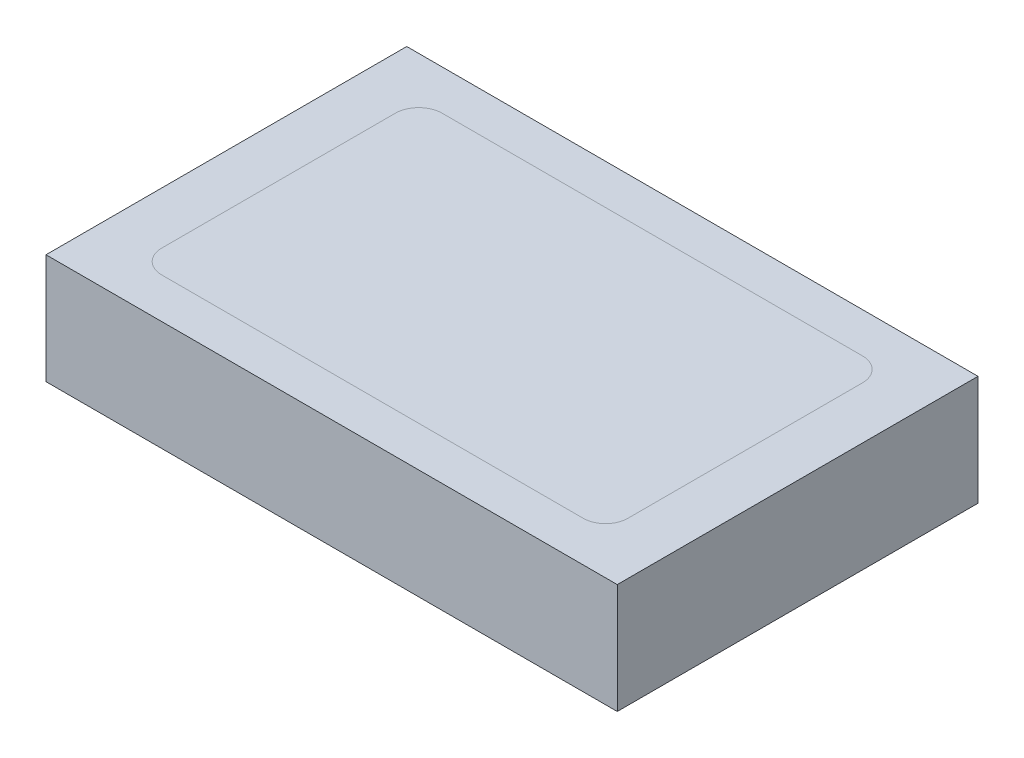
ISO-10303-21;
HEADER;
FILE_DESCRIPTION(('STEP AP214'),'2;1');
FILE_NAME('part.step','',(''),(''),'','','');
FILE_SCHEMA(('AUTOMOTIVE_DESIGN { 1 0 10303 214 1 1 1 1 }'));
ENDSEC;
DATA;
#1=APPLICATION_CONTEXT('core data for automotive mechanical design processes');
#2=APPLICATION_PROTOCOL_DEFINITION('international standard','automotive_design',2000,#1);
#3=PRODUCT_CONTEXT('',#1,'mechanical');
#4=PRODUCT('Part','Part','',(#3));
#5=PRODUCT_RELATED_PRODUCT_CATEGORY('part','',(#4));
#6=PRODUCT_DEFINITION_FORMATION('','',#4);
#7=PRODUCT_DEFINITION_CONTEXT('part definition',#1,'design');
#8=PRODUCT_DEFINITION('design','',#6,#7);
#9=PRODUCT_DEFINITION_SHAPE('','',#8);
#10=(LENGTH_UNIT() NAMED_UNIT(*) SI_UNIT(.MILLI.,.METRE.));
#11=(NAMED_UNIT(*) PLANE_ANGLE_UNIT() SI_UNIT($,.RADIAN.));
#12=(NAMED_UNIT(*) SI_UNIT($,.STERADIAN.) SOLID_ANGLE_UNIT());
#13=UNCERTAINTY_MEASURE_WITH_UNIT(LENGTH_MEASURE(1.E-05),#10,'distance_accuracy_value','');
#14=(GEOMETRIC_REPRESENTATION_CONTEXT(3) GLOBAL_UNCERTAINTY_ASSIGNED_CONTEXT((#13)) GLOBAL_UNIT_ASSIGNED_CONTEXT((#10,
#11,#12)) REPRESENTATION_CONTEXT('',''));
#15=CARTESIAN_POINT('',(0.,0.,0.));
#16=DIRECTION('',(0.,0.,1.));
#17=DIRECTION('',(1.,0.,0.));
#18=AXIS2_PLACEMENT_3D('',#15,#16,#17);
#19=CARTESIAN_POINT('',(64.2153631783628,-115.,40.5501296469417));
#20=DIRECTION('',(-1.,0.,0.));
#21=DIRECTION('',(0.,0.,1.));
#22=AXIS2_PLACEMENT_3D('',#19,#20,#21);
#23=PLANE('',#22);
#24=DIRECTION('',(0.,0.,-1.));
#25=VECTOR('',#24,1.);
#26=CARTESIAN_POINT('',(64.2153631783628,-150.284880451719,40.5501296469417));
#27=LINE('',#26,#25);
#28=CARTESIAN_POINT('',(64.2153631783628,-150.284880451719,40.5501296469417));
#29=VERTEX_POINT('',#28);
#30=CARTESIAN_POINT('',(64.2153631783628,-150.284880451719,-40.5501296469417));
#31=VERTEX_POINT('',#30);
#32=EDGE_CURVE('E59',#29,#31,#27,.T.);
#33=ORIENTED_EDGE('',*,*,#32,.F.);
#34=DIRECTION('',(0.,-1.,0.));
#35=VECTOR('',#34,1.);
#36=CARTESIAN_POINT('',(64.2153631783628,-115.,40.5501296469417));
#37=LINE('',#36,#35);
#38=CARTESIAN_POINT('',(64.2153631783628,-175.,40.5501296469417));
#39=VERTEX_POINT('',#38);
#40=EDGE_CURVE('E158',#29,#39,#37,.T.);
#41=ORIENTED_EDGE('',*,*,#40,.T.);
#42=DIRECTION('',(0.,0.,-1.));
#43=VECTOR('',#42,1.);
#44=CARTESIAN_POINT('',(64.2153631783628,-175.,40.5501296469417));
#45=LINE('',#44,#43);
#46=CARTESIAN_POINT('',(64.2153631783628,-175.,-40.5501296469417));
#47=VERTEX_POINT('',#46);
#48=EDGE_CURVE('E146',#39,#47,#45,.T.);
#49=ORIENTED_EDGE('',*,*,#48,.T.);
#50=DIRECTION('',(0.,-1.,0.));
#51=VECTOR('',#50,1.);
#52=CARTESIAN_POINT('',(64.2153631783628,-115.,-40.5501296469417));
#53=LINE('',#52,#51);
#54=EDGE_CURVE('E143',#31,#47,#53,.T.);
#55=ORIENTED_EDGE('',*,*,#54,.F.);
#56=EDGE_LOOP('',(#33,#41,#49,#55));
#57=FACE_BOUND('',#56,.T.);
#58=ADVANCED_FACE('F40',(#57),#23,.F.);
#59=CARTESIAN_POINT('',(-64.2153631783628,-115.,-40.5501296469417));
#60=DIRECTION('',(0.,0.,1.));
#61=DIRECTION('',(1.,0.,0.));
#62=AXIS2_PLACEMENT_3D('',#59,#60,#61);
#63=PLANE('',#62);
#64=DIRECTION('',(-1.,0.,0.));
#65=VECTOR('',#64,1.);
#66=CARTESIAN_POINT('',(-64.2153631783628,-150.284880451719,-40.5501296469417));
#67=LINE('',#66,#65);
#68=CARTESIAN_POINT('',(-64.2153631783628,-150.284880451719,-40.5501296469417));
#69=VERTEX_POINT('',#68);
#70=EDGE_CURVE('E142',#31,#69,#67,.T.);
#71=ORIENTED_EDGE('',*,*,#70,.F.);
#72=ORIENTED_EDGE('',*,*,#54,.T.);
#73=DIRECTION('',(-1.,0.,0.));
#74=VECTOR('',#73,1.);
#75=CARTESIAN_POINT('',(-64.2153631783628,-175.,-40.5501296469417));
#76=LINE('',#75,#74);
#77=CARTESIAN_POINT('',(-64.2153631783628,-175.,-40.5501296469417));
#78=VERTEX_POINT('',#77);
#79=EDGE_CURVE('E149',#47,#78,#76,.T.);
#80=ORIENTED_EDGE('',*,*,#79,.T.);
#81=DIRECTION('',(0.,-1.,0.));
#82=VECTOR('',#81,1.);
#83=CARTESIAN_POINT('',(-64.2153631783628,-115.,-40.5501296469417));
#84=LINE('',#83,#82);
#85=EDGE_CURVE('E164',#69,#78,#84,.T.);
#86=ORIENTED_EDGE('',*,*,#85,.F.);
#87=EDGE_LOOP('',(#71,#72,#80,#86));
#88=FACE_BOUND('',#87,.T.);
#89=ADVANCED_FACE('F171',(#88),#63,.F.);
#90=CARTESIAN_POINT('',(-64.2153631783628,-115.,40.5501296469417));
#91=DIRECTION('',(1.,0.,0.));
#92=DIRECTION('',(0.,0.,-1.));
#93=AXIS2_PLACEMENT_3D('',#90,#91,#92);
#94=PLANE('',#93);
#95=DIRECTION('',(0.,0.,1.));
#96=VECTOR('',#95,1.);
#97=CARTESIAN_POINT('',(-64.2153631783628,-150.284880451719,40.5501296469417));
#98=LINE('',#97,#96);
#99=CARTESIAN_POINT('',(-64.2153631783628,-150.284880451719,40.5501296469417));
#100=VERTEX_POINT('',#99);
#101=EDGE_CURVE('E134',#69,#100,#98,.T.);
#102=ORIENTED_EDGE('',*,*,#101,.F.);
#103=ORIENTED_EDGE('',*,*,#85,.T.);
#104=DIRECTION('',(0.,0.,1.));
#105=VECTOR('',#104,1.);
#106=CARTESIAN_POINT('',(-64.2153631783628,-175.,40.5501296469417));
#107=LINE('',#106,#105);
#108=CARTESIAN_POINT('',(-64.2153631783628,-175.,40.5501296469417));
#109=VERTEX_POINT('',#108);
#110=EDGE_CURVE('E152',#78,#109,#107,.T.);
#111=ORIENTED_EDGE('',*,*,#110,.T.);
#112=DIRECTION('',(0.,-1.,0.));
#113=VECTOR('',#112,1.);
#114=CARTESIAN_POINT('',(-64.2153631783628,-115.,40.5501296469417));
#115=LINE('',#114,#113);
#116=EDGE_CURVE('E161',#100,#109,#115,.T.);
#117=ORIENTED_EDGE('',*,*,#116,.F.);
#118=EDGE_LOOP('',(#102,#103,#111,#117));
#119=FACE_BOUND('',#118,.T.);
#120=ADVANCED_FACE('F244',(#119),#94,.F.);
#121=CARTESIAN_POINT('',(-64.2153631783628,-115.,40.5501296469417));
#122=DIRECTION('',(0.,0.,-1.));
#123=DIRECTION('',(-1.,0.,0.));
#124=AXIS2_PLACEMENT_3D('',#121,#122,#123);
#125=PLANE('',#124);
#126=DIRECTION('',(1.,0.,0.));
#127=VECTOR('',#126,1.);
#128=CARTESIAN_POINT('',(-64.2153631783628,-150.284880451719,40.5501296469417));
#129=LINE('',#128,#127);
#130=EDGE_CURVE('E43',#100,#29,#129,.T.);
#131=ORIENTED_EDGE('',*,*,#130,.F.);
#132=ORIENTED_EDGE('',*,*,#116,.T.);
#133=DIRECTION('',(1.,0.,0.));
#134=VECTOR('',#133,1.);
#135=CARTESIAN_POINT('',(-64.2153631783628,-175.,40.5501296469417));
#136=LINE('',#135,#134);
#137=EDGE_CURVE('E155',#109,#39,#136,.T.);
#138=ORIENTED_EDGE('',*,*,#137,.T.);
#139=ORIENTED_EDGE('',*,*,#40,.F.);
#140=EDGE_LOOP('',(#131,#132,#138,#139));
#141=FACE_BOUND('',#140,.T.);
#142=ADVANCED_FACE('F188',(#141),#125,.F.);
#143=CARTESIAN_POINT('',(0.,-175.,0.));
#144=DIRECTION('',(0.,-1.,0.));
#145=DIRECTION('',(0.,0.,-1.));
#146=AXIS2_PLACEMENT_3D('',#143,#144,#145);
#147=PLANE('',#146);
#148=ORIENTED_EDGE('',*,*,#48,.F.);
#149=ORIENTED_EDGE('',*,*,#137,.F.);
#150=ORIENTED_EDGE('',*,*,#110,.F.);
#151=ORIENTED_EDGE('',*,*,#79,.F.);
#152=EDGE_LOOP('',(#148,#149,#150,#151));
#153=FACE_BOUND('',#152,.T.);
#154=ADVANCED_FACE('F179',(#153),#147,.T.);
#155=CARTESIAN_POINT('',(47.25,-150.284880451719,-31.5403781716258));
#156=DIRECTION('',(0.,1.,0.));
#157=DIRECTION('',(0.707106781186548,0.,0.707106781186547));
#158=AXIS2_PLACEMENT_3D('',#155,#156,#157);
#159=PLANE('',#158);
#160=CARTESIAN_POINT('',(47.25,-150.284880451719,-31.5403781716258));
#161=CARTESIAN_POINT('',(47.7672918128204,-150.284880451719,-31.5403781716258));
#162=CARTESIAN_POINT('',(48.2751942980429,-150.284880451719,-31.4394053464978));
#163=CARTESIAN_POINT('',(48.7822900888563,-150.284880451719,-31.3385928950949));
#164=CARTESIAN_POINT('',(49.2609909541477,-150.284880451719,-31.1403672001572));
#165=CARTESIAN_POINT('',(49.7386755079114,-150.284880451719,-30.9425623506232));
#166=CARTESIAN_POINT('',(50.1695063556612,-150.284880451719,-30.6547556008654));
#167=CARTESIAN_POINT('',(50.59942252288,-150.284880451719,-30.3675598826345));
#168=CARTESIAN_POINT('',(50.9658267652048,-150.284880451719,-30.0012323300491));
#169=CARTESIAN_POINT('',(51.3314531086761,-150.284880451719,-29.6356825135));
#170=CARTESIAN_POINT('',(51.6193500360211,-150.284880451719,-29.2049119205055));
#171=CARTESIAN_POINT('',(51.9066357403987,-150.284880451719,-28.7750558800997));
#172=CARTESIAN_POINT('',(52.1049616353129,-150.284880451719,-28.296396518992));
#173=CARTESIAN_POINT('',(52.3028664720921,-150.284880451719,-27.8187533812978));
#174=CARTESIAN_POINT('',(52.4039997816535,-150.284880451719,-27.3105998628872));
#175=CARTESIAN_POINT('',(52.5049726067815,-150.284880451719,-26.8032527131186));
#176=CARTESIAN_POINT('',(52.5049726067815,-150.284880451719,-26.2854055648443));
#177=B_SPLINE_CURVE_WITH_KNOTS('',2,(#160,#161,#162,#163,#164,#165,#166,#167,#168,#169,#170,
#171,#172,#173,#174,#175,#176),.UNSPECIFIED.,.F.,.F.,(3,2,2,2,2,2,2,2,3),(0.,0.125,0.25,0.375,
0.5,0.625,0.75,0.875,1.),.UNSPECIFIED.);
#178=CARTESIAN_POINT('',(47.25,-150.284880451719,-31.5403781716258));
#179=VERTEX_POINT('',#178);
#180=CARTESIAN_POINT('',(52.5049726067815,-150.284880451719,-26.2854055648443));
#181=VERTEX_POINT('',#180);
#182=EDGE_CURVE('E126',#179,#181,#177,.T.);
#183=ORIENTED_EDGE('',*,*,#182,.T.);
#184=DIRECTION('',(0.,0.,1.));
#185=VECTOR('',#184,1.);
#186=CARTESIAN_POINT('',(52.5049726067815,-150.284880451719,0.));
#187=LINE('',#186,#185);
#188=CARTESIAN_POINT('',(52.5049726067815,-150.284880451719,26.4703285661553));
#189=VERTEX_POINT('',#188);
#190=EDGE_CURVE('E11',#189,#181,#187,.F.);
#191=ORIENTED_EDGE('',*,*,#190,.F.);
#192=CARTESIAN_POINT('',(52.5049726067815,-150.284880451719,26.4703285661553));
#193=CARTESIAN_POINT('',(52.5049726067815,-150.284880451719,26.9624866761196));
#194=CARTESIAN_POINT('',(52.4089215148702,-150.284880451719,27.4457127258932));
#195=CARTESIAN_POINT('',(52.3130307389651,-150.284880451719,27.9281322375127));
#196=CARTESIAN_POINT('',(52.1244580019849,-150.284880451719,28.3835693960469));
#197=CARTESIAN_POINT('',(51.9363059635643,-150.284880451719,28.8379904917097));
#198=CARTESIAN_POINT('',(51.6625096159622,-150.284880451719,29.2478712017061));
#199=CARTESIAN_POINT('',(51.3893240975313,-150.284880451719,29.6568374835276));
#200=CARTESIAN_POINT('',(51.0408219124099,-150.284880451719,30.0054163475656));
#201=CARTESIAN_POINT('',(50.6930972223333,-150.284880451719,30.3532175454911));
#202=CARTESIAN_POINT('',(50.2832767665504,-150.284880451719,30.6271040511178));
#203=CARTESIAN_POINT('',(49.8743706045334,-150.284880451719,30.9003795264236));
#204=CARTESIAN_POINT('',(49.4189749608912,-150.284880451719,31.0890524371406));
#205=CARTESIAN_POINT('',(48.9645952875172,-150.284880451719,31.2773044258079));
#206=CARTESIAN_POINT('',(48.4811182907375,-150.284880451719,31.3735159500259));
#207=CARTESIAN_POINT('',(47.99844748979,-150.284880451719,31.4695670419372));
#208=CARTESIAN_POINT('',(47.5057341309996,-150.284880451719,31.4695670419372));
#209=B_SPLINE_CURVE_WITH_KNOTS('',2,(#192,#193,#194,#195,#196,#197,#198,#199,#200,#201,#202,
#203,#204,#205,#206,#207,#208),.UNSPECIFIED.,.F.,.F.,(3,2,2,2,2,2,2,2,3),(0.,0.125,0.25,0.375,
0.5,0.625,0.75,0.875,1.),.UNSPECIFIED.);
#210=CARTESIAN_POINT('',(47.5057341309996,-150.284880451719,31.4695670419372));
#211=VERTEX_POINT('',#210);
#212=EDGE_CURVE('E50',#189,#211,#209,.T.);
#213=ORIENTED_EDGE('',*,*,#212,.T.);
#214=DIRECTION('',(-1.,0.,0.));
#215=VECTOR('',#214,1.);
#216=CARTESIAN_POINT('',(0.,-150.284880451719,31.4695670419372));
#217=LINE('',#216,#215);
#218=CARTESIAN_POINT('',(-47.25,-150.284880451719,31.4695670419372));
#219=VERTEX_POINT('',#218);
#220=EDGE_CURVE('E107',#219,#211,#217,.F.);
#221=ORIENTED_EDGE('',*,*,#220,.F.);
#222=CARTESIAN_POINT('',(-47.25,-150.284880451719,31.4695670419372));
#223=CARTESIAN_POINT('',(-47.7672918128204,-150.284880451719,31.4695670419372));
#224=CARTESIAN_POINT('',(-48.2751942980429,-150.284880451719,31.3685942168092));
#225=CARTESIAN_POINT('',(-48.7822900888625,-150.284880451719,31.267781765405));
#226=CARTESIAN_POINT('',(-49.2609909541477,-150.284880451719,31.0695560704686));
#227=CARTESIAN_POINT('',(-49.7386755079167,-150.284880451719,30.871751220931));
#228=CARTESIAN_POINT('',(-50.1695063556612,-150.284880451719,30.5839444711768));
#229=CARTESIAN_POINT('',(-50.59942252288,-150.284880451719,30.2967487529459));
#230=CARTESIAN_POINT('',(-50.9658267652048,-150.284880451719,29.9304212003605));
#231=CARTESIAN_POINT('',(-51.3314531086761,-150.284880451719,29.5648713838114));
#232=CARTESIAN_POINT('',(-51.6193500360211,-150.284880451719,29.1341007908169));
#233=CARTESIAN_POINT('',(-51.9066357403973,-150.284880451719,28.7042447504132));
#234=CARTESIAN_POINT('',(-52.1049616353129,-150.284880451719,28.2255853893034));
#235=CARTESIAN_POINT('',(-52.3028664720872,-150.284880451719,27.7479422516224));
#236=CARTESIAN_POINT('',(-52.4039997816535,-150.284880451719,27.2397887331986));
#237=CARTESIAN_POINT('',(-52.5049726067815,-150.284880451719,26.7324415834415));
#238=CARTESIAN_POINT('',(-52.5049726067815,-150.284880451719,26.2145944351557));
#239=B_SPLINE_CURVE_WITH_KNOTS('',2,(#222,#223,#224,#225,#226,#227,#228,#229,#230,#231,#232,
#233,#234,#235,#236,#237,#238),.UNSPECIFIED.,.F.,.F.,(3,2,2,2,2,2,2,2,3),(0.,0.125,0.25,0.375,
0.5,0.625,0.75,0.875,1.),.UNSPECIFIED.);
#240=CARTESIAN_POINT('',(-52.5049726067815,-150.284880451719,26.2145944351557));
#241=VERTEX_POINT('',#240);
#242=EDGE_CURVE('E99',#219,#241,#239,.T.);
#243=ORIENTED_EDGE('',*,*,#242,.T.);
#244=DIRECTION('',(0.,0.,-1.));
#245=VECTOR('',#244,1.);
#246=CARTESIAN_POINT('',(-52.5049726067815,-150.284880451719,0.));
#247=LINE('',#246,#245);
#248=CARTESIAN_POINT('',(-52.5049726067815,-150.284880451719,-26.2854055648443));
#249=VERTEX_POINT('',#248);
#250=EDGE_CURVE('E88',#249,#241,#247,.F.);
#251=ORIENTED_EDGE('',*,*,#250,.F.);
#252=CARTESIAN_POINT('',(-52.5049726067815,-150.284880451719,-26.2854055648443));
#253=CARTESIAN_POINT('',(-52.5049726067815,-150.284880451719,-26.8026973776482));
#254=CARTESIAN_POINT('',(-52.4039997816535,-150.284880451719,-27.3105998628872));
#255=CARTESIAN_POINT('',(-52.3031873302599,-150.284880451719,-27.8176956536703));
#256=CARTESIAN_POINT('',(-52.104961635313,-150.284880451719,-28.296396518992));
#257=CARTESIAN_POINT('',(-51.9071567857857,-150.284880451719,-28.7740810727471));
#258=CARTESIAN_POINT('',(-51.6193500360212,-150.284880451719,-29.2049119205056));
#259=CARTESIAN_POINT('',(-51.3321543177935,-150.284880451719,-29.6348280877178));
#260=CARTESIAN_POINT('',(-50.9658267652048,-150.284880451719,-30.0012323300491));
#261=CARTESIAN_POINT('',(-50.6002769486721,-150.284880451719,-30.3668586735073));
#262=CARTESIAN_POINT('',(-50.1695063556613,-150.284880451719,-30.6547556008654));
#263=CARTESIAN_POINT('',(-49.7396503152662,-150.284880451719,-30.942041305238));
#264=CARTESIAN_POINT('',(-49.2609909541477,-150.284880451719,-31.1403672001573));
#265=CARTESIAN_POINT('',(-48.7833478164501,-150.284880451719,-31.3382720369384));
#266=CARTESIAN_POINT('',(-48.275194298043,-150.284880451719,-31.4394053464978));
#267=CARTESIAN_POINT('',(-47.7678471482678,-150.284880451719,-31.5403781716258));
#268=CARTESIAN_POINT('',(-47.25,-150.284880451719,-31.5403781716258));
#269=B_SPLINE_CURVE_WITH_KNOTS('',2,(#252,#253,#254,#255,#256,#257,#258,#259,#260,#261,#262,
#263,#264,#265,#266,#267,#268),.UNSPECIFIED.,.F.,.F.,(3,2,2,2,2,2,2,2,3),(0.,0.125,0.25,0.375,
0.5,0.625,0.75,0.875,1.),.UNSPECIFIED.);
#270=CARTESIAN_POINT('',(-47.25,-150.284880451719,-31.5403781716258));
#271=VERTEX_POINT('',#270);
#272=EDGE_CURVE('E85',#249,#271,#269,.T.);
#273=ORIENTED_EDGE('',*,*,#272,.T.);
#274=DIRECTION('',(1.,0.,0.));
#275=VECTOR('',#274,1.);
#276=CARTESIAN_POINT('',(0.,-150.284880451719,-31.5403781716258));
#277=LINE('',#276,#275);
#278=EDGE_CURVE('E92',#179,#271,#277,.F.);
#279=ORIENTED_EDGE('',*,*,#278,.F.);
#280=EDGE_LOOP('',(#183,#191,#213,#221,#243,#251,#273,#279));
#281=FACE_BOUND('',#280,.T.);
#282=ORIENTED_EDGE('',*,*,#32,.T.);
#283=ORIENTED_EDGE('',*,*,#70,.T.);
#284=ORIENTED_EDGE('',*,*,#101,.T.);
#285=ORIENTED_EDGE('',*,*,#130,.T.);
#286=EDGE_LOOP('',(#282,#283,#284,#285));
#287=FACE_BOUND('',#286,.T.);
#288=ADVANCED_FACE('F97',(#281,#287),#159,.T.);
#289=CARTESIAN_POINT('',(0.,-150.284880451719,-0.0354055648443107));
#290=DIRECTION('',(0.,1.,0.));
#291=DIRECTION('',(0.,0.,1.));
#292=AXIS2_PLACEMENT_3D('',#289,#290,#291);
#293=PLANE('',#292);
#294=ORIENTED_EDGE('',*,*,#190,.T.);
#295=ORIENTED_EDGE('',*,*,#182,.F.);
#296=ORIENTED_EDGE('',*,*,#278,.T.);
#297=ORIENTED_EDGE('',*,*,#272,.F.);
#298=ORIENTED_EDGE('',*,*,#250,.T.);
#299=ORIENTED_EDGE('',*,*,#242,.F.);
#300=ORIENTED_EDGE('',*,*,#220,.T.);
#301=ORIENTED_EDGE('',*,*,#212,.F.);
#302=EDGE_LOOP('',(#294,#295,#296,#297,#298,#299,#300,#301));
#303=FACE_BOUND('',#302,.T.);
#304=ADVANCED_FACE('F87',(#303),#293,.T.);
#305=CLOSED_SHELL('',(#58,#89,#120,#142,#154,#288,#304));
#306=MANIFOLD_SOLID_BREP('B2',#305);
#307=ADVANCED_BREP_SHAPE_REPRESENTATION('',(#18,#306),#14);
#308=SHAPE_DEFINITION_REPRESENTATION(#9,#307);
ENDSEC;
END-ISO-10303-21;
